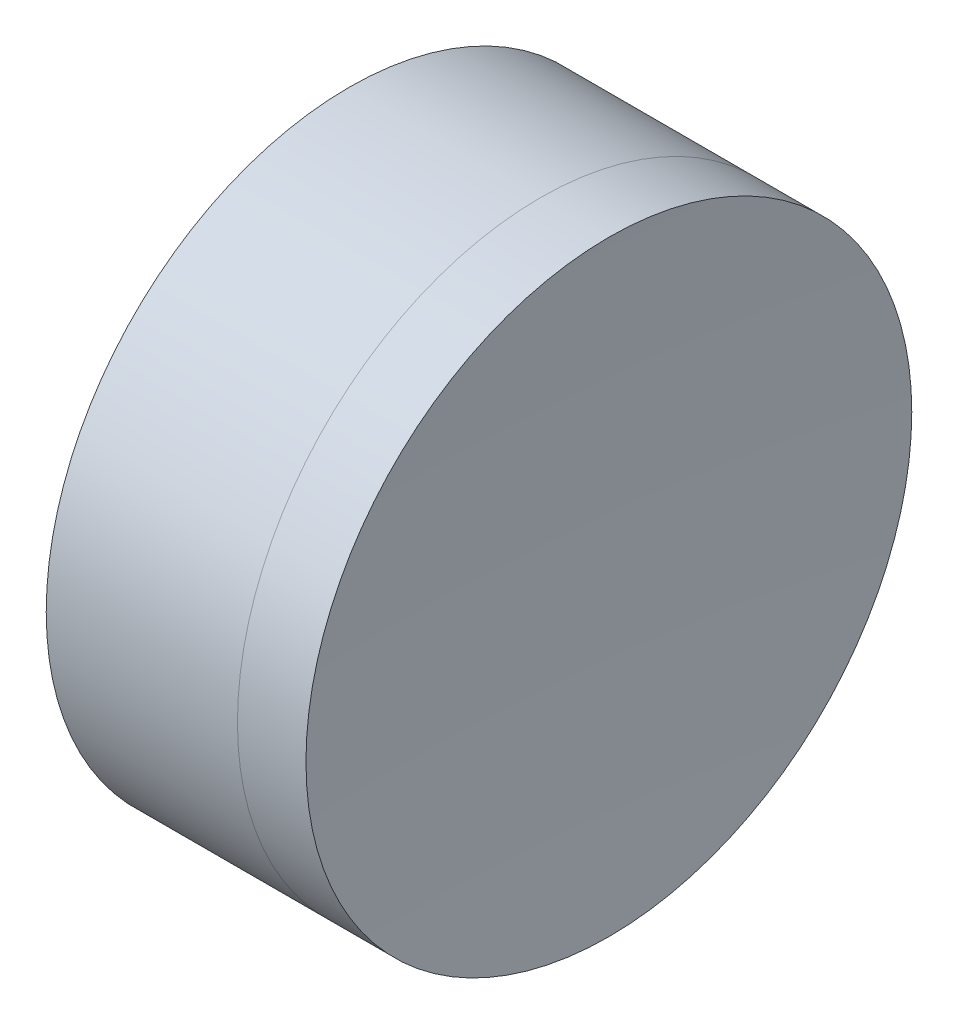
ISO-10303-21;
HEADER;
FILE_DESCRIPTION(('STEP AP214'),'2;1');
FILE_NAME('part.step','',(''),(''),'','','');
FILE_SCHEMA(('AUTOMOTIVE_DESIGN { 1 0 10303 214 1 1 1 1 }'));
ENDSEC;
DATA;
#1=APPLICATION_CONTEXT('core data for automotive mechanical design processes');
#2=APPLICATION_PROTOCOL_DEFINITION('international standard','automotive_design',2000,#1);
#3=PRODUCT_CONTEXT('',#1,'mechanical');
#4=PRODUCT('Part','Part','',(#3));
#5=PRODUCT_RELATED_PRODUCT_CATEGORY('part','',(#4));
#6=PRODUCT_DEFINITION_FORMATION('','',#4);
#7=PRODUCT_DEFINITION_CONTEXT('part definition',#1,'design');
#8=PRODUCT_DEFINITION('design','',#6,#7);
#9=PRODUCT_DEFINITION_SHAPE('','',#8);
#10=(LENGTH_UNIT() NAMED_UNIT(*) SI_UNIT(.MILLI.,.METRE.));
#11=(NAMED_UNIT(*) PLANE_ANGLE_UNIT() SI_UNIT($,.RADIAN.));
#12=(NAMED_UNIT(*) SI_UNIT($,.STERADIAN.) SOLID_ANGLE_UNIT());
#13=UNCERTAINTY_MEASURE_WITH_UNIT(LENGTH_MEASURE(1.E-05),#10,'distance_accuracy_value','');
#14=(GEOMETRIC_REPRESENTATION_CONTEXT(3) GLOBAL_UNCERTAINTY_ASSIGNED_CONTEXT((#13)) GLOBAL_UNIT_ASSIGNED_CONTEXT((#10,
#11,#12)) REPRESENTATION_CONTEXT('',''));
#15=CARTESIAN_POINT('',(0.,0.,0.));
#16=DIRECTION('',(0.,0.,1.));
#17=DIRECTION('',(1.,0.,0.));
#18=AXIS2_PLACEMENT_3D('',#15,#16,#17);
#19=CARTESIAN_POINT('',(247.311519117899,0.,0.));
#20=DIRECTION('',(-1.,0.,0.));
#21=DIRECTION('',(0.,0.,1.));
#22=AXIS2_PLACEMENT_3D('',#19,#20,#21);
#23=SPHERICAL_SURFACE('',#22,16.5000000000003);
#24=CARTESIAN_POINT('',(232.082353021227,0.,0.));
#25=DIRECTION('',(-1.,0.,0.));
#26=DIRECTION('',(0.,0.,1.));
#27=AXIS2_PLACEMENT_3D('',#24,#25,#26);
#28=CIRCLE('',#27,6.34999999999999);
#29=CARTESIAN_POINT('',(232.082353021227,0.,6.34999999999999));
#30=VERTEX_POINT('',#29);
#31=EDGE_CURVE('E11',#30,#30,#28,.T.);
#32=ORIENTED_EDGE('',*,*,#31,.T.);
#33=EDGE_LOOP('',(#32));
#34=FACE_BOUND('',#33,.T.);
#35=ADVANCED_FACE('F45',(#34),#23,.T.);
#36=CARTESIAN_POINT('',(228.073176118357,0.,0.));
#37=DIRECTION('',(-1.,0.,0.));
#38=DIRECTION('',(0.,0.,1.));
#39=AXIS2_PLACEMENT_3D('',#36,#37,#38);
#40=CYLINDRICAL_SURFACE('',#39,6.35);
#41=CARTESIAN_POINT('',(233.518096262816,0.,0.));
#42=DIRECTION('',(-1.,0.,0.));
#43=DIRECTION('',(0.,0.,1.));
#44=AXIS2_PLACEMENT_3D('',#41,#42,#43);
#45=CIRCLE('',#44,6.35);
#46=CARTESIAN_POINT('',(233.518096262816,0.,6.35));
#47=VERTEX_POINT('',#46);
#48=EDGE_CURVE('E51',#47,#47,#45,.T.);
#49=ORIENTED_EDGE('',*,*,#48,.T.);
#50=EDGE_LOOP('',(#49));
#51=FACE_BOUND('',#50,.T.);
#52=ORIENTED_EDGE('',*,*,#31,.F.);
#53=EDGE_LOOP('',(#52));
#54=FACE_BOUND('',#53,.T.);
#55=ADVANCED_FACE('F57',(#51,#54),#40,.T.);
#56=CARTESIAN_POINT('',(331.011519117899,0.,0.));
#57=DIRECTION('',(-1.,0.,0.));
#58=DIRECTION('',(0.,0.,-1.));
#59=AXIS2_PLACEMENT_3D('',#56,#57,#58);
#60=SPHERICAL_SURFACE('',#59,97.7);
#61=ORIENTED_EDGE('',*,*,#48,.F.);
#62=EDGE_LOOP('',(#61));
#63=FACE_BOUND('',#62,.T.);
#64=ADVANCED_FACE('F60',(#63),#60,.F.);
#65=CLOSED_SHELL('',(#35,#55,#64));
#66=MANIFOLD_SOLID_BREP('B2',#65);
#67=CARTESIAN_POINT('',(212.411519117899,0.,0.));
#68=DIRECTION('',(-1.,0.,0.));
#69=DIRECTION('',(0.,0.,1.));
#70=AXIS2_PLACEMENT_3D('',#67,#68,#69);
#71=SPHERICAL_SURFACE('',#70,16.9);
#72=CARTESIAN_POINT('',(228.073176118357,0.,0.));
#73=DIRECTION('',(-1.,0.,0.));
#74=DIRECTION('',(0.,0.,1.));
#75=AXIS2_PLACEMENT_3D('',#72,#73,#74);
#76=CIRCLE('',#75,6.35000000000004);
#77=CARTESIAN_POINT('',(228.073176118357,0.,6.35));
#78=VERTEX_POINT('',#77);
#79=EDGE_CURVE('E44',#78,#78,#76,.T.);
#80=ORIENTED_EDGE('',*,*,#79,.T.);
#81=EDGE_LOOP('',(#80));
#82=FACE_BOUND('',#81,.T.);
#83=ADVANCED_FACE('F86',(#82),#71,.F.);
#84=CARTESIAN_POINT('',(-0.816062176165804,0.,0.));
#85=DIRECTION('',(-1.,0.,0.));
#86=DIRECTION('',(0.,0.,1.));
#87=AXIS2_PLACEMENT_3D('',#84,#85,#86);
#88=CYLINDRICAL_SURFACE('',#87,6.35000000000004);
#89=CARTESIAN_POINT('',(232.082353021227,0.,0.));
#90=DIRECTION('',(-1.,0.,0.));
#91=DIRECTION('',(0.,0.,1.));
#92=AXIS2_PLACEMENT_3D('',#89,#90,#91);
#93=CIRCLE('',#92,6.35000000000004);
#94=CARTESIAN_POINT('',(232.082353021227,0.,6.35));
#95=VERTEX_POINT('',#94);
#96=EDGE_CURVE('E92',#95,#95,#93,.T.);
#97=ORIENTED_EDGE('',*,*,#96,.T.);
#98=EDGE_LOOP('',(#97));
#99=FACE_BOUND('',#98,.T.);
#100=ORIENTED_EDGE('',*,*,#79,.F.);
#101=EDGE_LOOP('',(#100));
#102=FACE_BOUND('',#101,.T.);
#103=ADVANCED_FACE('F98',(#99,#102),#88,.T.);
#104=CARTESIAN_POINT('',(247.311519117899,0.,0.));
#105=DIRECTION('',(-1.,0.,0.));
#106=DIRECTION('',(0.,0.,-1.));
#107=AXIS2_PLACEMENT_3D('',#104,#105,#106);
#108=SPHERICAL_SURFACE('',#107,16.5000000000003);
#109=ORIENTED_EDGE('',*,*,#96,.F.);
#110=EDGE_LOOP('',(#109));
#111=FACE_BOUND('',#110,.T.);
#112=ADVANCED_FACE('F101',(#111),#108,.F.);
#113=CLOSED_SHELL('',(#83,#103,#112));
#114=MANIFOLD_SOLID_BREP('B6',#113);
#115=ADVANCED_BREP_SHAPE_REPRESENTATION('',(#18,#66,#114),#14);
#116=SHAPE_DEFINITION_REPRESENTATION(#9,#115);
ENDSEC;
END-ISO-10303-21;
